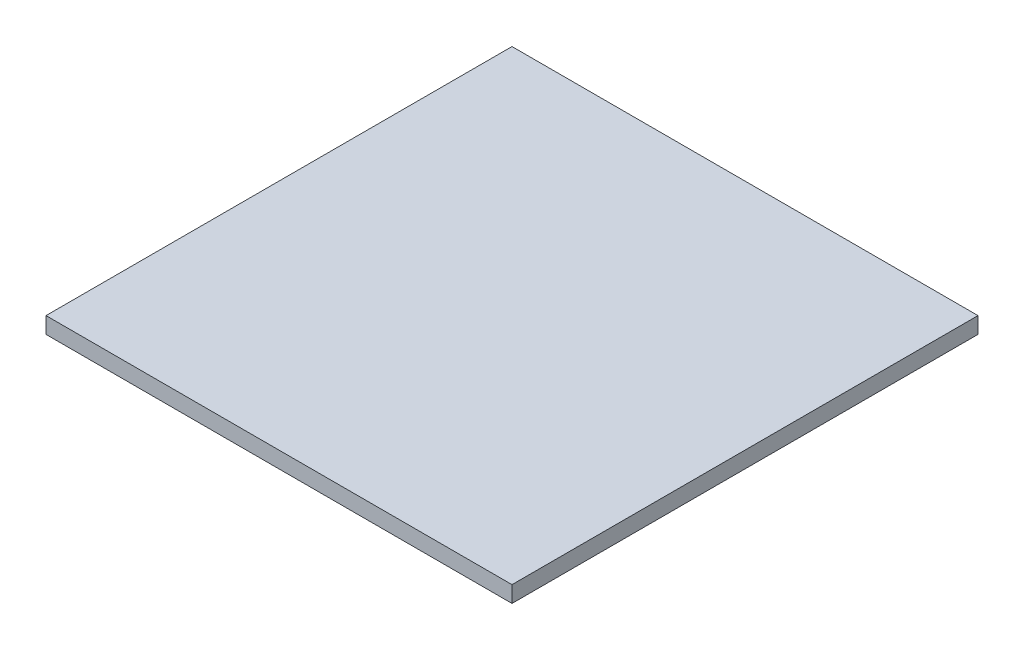
ISO-10303-21;
HEADER;
FILE_DESCRIPTION(('STEP AP214'),'2;1');
FILE_NAME('part.step','',(''),(''),'','','');
FILE_SCHEMA(('AUTOMOTIVE_DESIGN { 1 0 10303 214 1 1 1 1 }'));
ENDSEC;
DATA;
#1=APPLICATION_CONTEXT('core data for automotive mechanical design processes');
#2=APPLICATION_PROTOCOL_DEFINITION('international standard','automotive_design',2000,#1);
#3=PRODUCT_CONTEXT('',#1,'mechanical');
#4=PRODUCT('Part','Part','',(#3));
#5=PRODUCT_RELATED_PRODUCT_CATEGORY('part','',(#4));
#6=PRODUCT_DEFINITION_FORMATION('','',#4);
#7=PRODUCT_DEFINITION_CONTEXT('part definition',#1,'design');
#8=PRODUCT_DEFINITION('design','',#6,#7);
#9=PRODUCT_DEFINITION_SHAPE('','',#8);
#10=(LENGTH_UNIT() NAMED_UNIT(*) SI_UNIT(.MILLI.,.METRE.));
#11=(NAMED_UNIT(*) PLANE_ANGLE_UNIT() SI_UNIT($,.RADIAN.));
#12=(NAMED_UNIT(*) SI_UNIT($,.STERADIAN.) SOLID_ANGLE_UNIT());
#13=UNCERTAINTY_MEASURE_WITH_UNIT(LENGTH_MEASURE(1.E-05),#10,'distance_accuracy_value','');
#14=(GEOMETRIC_REPRESENTATION_CONTEXT(3) GLOBAL_UNCERTAINTY_ASSIGNED_CONTEXT((#13)) GLOBAL_UNIT_ASSIGNED_CONTEXT((#10,
#11,#12)) REPRESENTATION_CONTEXT('',''));
#15=CARTESIAN_POINT('',(0.,0.,0.));
#16=DIRECTION('',(0.,0.,1.));
#17=DIRECTION('',(1.,0.,0.));
#18=AXIS2_PLACEMENT_3D('',#15,#16,#17);
#19=CARTESIAN_POINT('',(0.,3.5,0.));
#20=DIRECTION('',(1.,0.,0.));
#21=DIRECTION('',(0.,0.,-1.));
#22=AXIS2_PLACEMENT_3D('',#19,#20,#21);
#23=PLANE('',#22);
#24=DIRECTION('',(0.,0.,1.));
#25=VECTOR('',#24,1.);
#26=CARTESIAN_POINT('',(0.,0.,0.));
#27=LINE('',#26,#25);
#28=CARTESIAN_POINT('',(0.,0.,-100.));
#29=VERTEX_POINT('',#28);
#30=CARTESIAN_POINT('',(0.,0.,0.));
#31=VERTEX_POINT('',#30);
#32=EDGE_CURVE('E96',#29,#31,#27,.T.);
#33=ORIENTED_EDGE('',*,*,#32,.T.);
#34=DIRECTION('',(0.,-1.,0.));
#35=VECTOR('',#34,1.);
#36=CARTESIAN_POINT('',(0.,3.5,0.));
#37=LINE('',#36,#35);
#38=CARTESIAN_POINT('',(0.,3.5,0.));
#39=VERTEX_POINT('',#38);
#40=EDGE_CURVE('E11',#39,#31,#37,.T.);
#41=ORIENTED_EDGE('',*,*,#40,.F.);
#42=DIRECTION('',(0.,0.,1.));
#43=VECTOR('',#42,1.);
#44=CARTESIAN_POINT('',(0.,3.5,0.));
#45=LINE('',#44,#43);
#46=CARTESIAN_POINT('',(0.,3.5,-100.));
#47=VERTEX_POINT('',#46);
#48=EDGE_CURVE('E84',#47,#39,#45,.T.);
#49=ORIENTED_EDGE('',*,*,#48,.F.);
#50=DIRECTION('',(0.,-1.,0.));
#51=VECTOR('',#50,1.);
#52=CARTESIAN_POINT('',(0.,3.5,-100.));
#53=LINE('',#52,#51);
#54=EDGE_CURVE('E92',#47,#29,#53,.T.);
#55=ORIENTED_EDGE('',*,*,#54,.T.);
#56=EDGE_LOOP('',(#33,#41,#49,#55));
#57=FACE_BOUND('',#56,.T.);
#58=ADVANCED_FACE('F33',(#57),#23,.F.);
#59=CARTESIAN_POINT('',(0.,3.5,0.));
#60=DIRECTION('',(0.,0.,-1.));
#61=DIRECTION('',(-1.,0.,0.));
#62=AXIS2_PLACEMENT_3D('',#59,#60,#61);
#63=PLANE('',#62);
#64=DIRECTION('',(1.,0.,0.));
#65=VECTOR('',#64,1.);
#66=CARTESIAN_POINT('',(0.,0.,0.));
#67=LINE('',#66,#65);
#68=CARTESIAN_POINT('',(100.,0.,0.));
#69=VERTEX_POINT('',#68);
#70=EDGE_CURVE('E88',#31,#69,#67,.T.);
#71=ORIENTED_EDGE('',*,*,#70,.T.);
#72=DIRECTION('',(0.,-1.,0.));
#73=VECTOR('',#72,1.);
#74=CARTESIAN_POINT('',(100.,3.5,0.));
#75=LINE('',#74,#73);
#76=CARTESIAN_POINT('',(100.,3.5,0.));
#77=VERTEX_POINT('',#76);
#78=EDGE_CURVE('E41',#77,#69,#75,.T.);
#79=ORIENTED_EDGE('',*,*,#78,.F.);
#80=DIRECTION('',(1.,0.,0.));
#81=VECTOR('',#80,1.);
#82=CARTESIAN_POINT('',(0.,3.5,0.));
#83=LINE('',#82,#81);
#84=EDGE_CURVE('E79',#39,#77,#83,.T.);
#85=ORIENTED_EDGE('',*,*,#84,.F.);
#86=ORIENTED_EDGE('',*,*,#40,.T.);
#87=EDGE_LOOP('',(#71,#79,#85,#86));
#88=FACE_BOUND('',#87,.T.);
#89=ADVANCED_FACE('F87',(#88),#63,.F.);
#90=CARTESIAN_POINT('',(100.,3.5,0.));
#91=DIRECTION('',(-1.,0.,0.));
#92=DIRECTION('',(0.,0.,1.));
#93=AXIS2_PLACEMENT_3D('',#90,#91,#92);
#94=PLANE('',#93);
#95=DIRECTION('',(0.,0.,-1.));
#96=VECTOR('',#95,1.);
#97=CARTESIAN_POINT('',(100.,0.,0.));
#98=LINE('',#97,#96);
#99=CARTESIAN_POINT('',(100.,0.,-100.));
#100=VERTEX_POINT('',#99);
#101=EDGE_CURVE('E66',#69,#100,#98,.T.);
#102=ORIENTED_EDGE('',*,*,#101,.T.);
#103=DIRECTION('',(0.,-1.,0.));
#104=VECTOR('',#103,1.);
#105=CARTESIAN_POINT('',(100.,3.5,-100.));
#106=LINE('',#105,#104);
#107=CARTESIAN_POINT('',(100.,3.5,-100.));
#108=VERTEX_POINT('',#107);
#109=EDGE_CURVE('E89',#108,#100,#106,.T.);
#110=ORIENTED_EDGE('',*,*,#109,.F.);
#111=DIRECTION('',(0.,0.,-1.));
#112=VECTOR('',#111,1.);
#113=CARTESIAN_POINT('',(100.,3.5,0.));
#114=LINE('',#113,#112);
#115=EDGE_CURVE('E82',#77,#108,#114,.T.);
#116=ORIENTED_EDGE('',*,*,#115,.F.);
#117=ORIENTED_EDGE('',*,*,#78,.T.);
#118=EDGE_LOOP('',(#102,#110,#116,#117));
#119=FACE_BOUND('',#118,.T.);
#120=ADVANCED_FACE('F90',(#119),#94,.F.);
#121=CARTESIAN_POINT('',(0.,3.5,-100.));
#122=DIRECTION('',(0.,0.,1.));
#123=DIRECTION('',(1.,0.,0.));
#124=AXIS2_PLACEMENT_3D('',#121,#122,#123);
#125=PLANE('',#124);
#126=DIRECTION('',(-1.,0.,0.));
#127=VECTOR('',#126,1.);
#128=CARTESIAN_POINT('',(0.,0.,-100.));
#129=LINE('',#128,#127);
#130=EDGE_CURVE('E72',#100,#29,#129,.T.);
#131=ORIENTED_EDGE('',*,*,#130,.T.);
#132=ORIENTED_EDGE('',*,*,#54,.F.);
#133=DIRECTION('',(-1.,0.,0.));
#134=VECTOR('',#133,1.);
#135=CARTESIAN_POINT('',(0.,3.5,-100.));
#136=LINE('',#135,#134);
#137=EDGE_CURVE('E49',#108,#47,#136,.T.);
#138=ORIENTED_EDGE('',*,*,#137,.F.);
#139=ORIENTED_EDGE('',*,*,#109,.T.);
#140=EDGE_LOOP('',(#131,#132,#138,#139));
#141=FACE_BOUND('',#140,.T.);
#142=ADVANCED_FACE('F103',(#141),#125,.F.);
#143=CARTESIAN_POINT('',(0.,3.5,0.));
#144=DIRECTION('',(0.,-1.,0.));
#145=DIRECTION('',(0.,0.,-1.));
#146=AXIS2_PLACEMENT_3D('',#143,#144,#145);
#147=PLANE('',#146);
#148=ORIENTED_EDGE('',*,*,#48,.T.);
#149=ORIENTED_EDGE('',*,*,#84,.T.);
#150=ORIENTED_EDGE('',*,*,#115,.T.);
#151=ORIENTED_EDGE('',*,*,#137,.T.);
#152=EDGE_LOOP('',(#148,#149,#150,#151));
#153=FACE_BOUND('',#152,.T.);
#154=ADVANCED_FACE('F80',(#153),#147,.F.);
#155=CARTESIAN_POINT('',(0.,0.,0.));
#156=DIRECTION('',(0.,-1.,0.));
#157=DIRECTION('',(0.,0.,-1.));
#158=AXIS2_PLACEMENT_3D('',#155,#156,#157);
#159=PLANE('',#158);
#160=ORIENTED_EDGE('',*,*,#32,.F.);
#161=ORIENTED_EDGE('',*,*,#130,.F.);
#162=ORIENTED_EDGE('',*,*,#101,.F.);
#163=ORIENTED_EDGE('',*,*,#70,.F.);
#164=EDGE_LOOP('',(#160,#161,#162,#163));
#165=FACE_BOUND('',#164,.T.);
#166=ADVANCED_FACE('F106',(#165),#159,.T.);
#167=CLOSED_SHELL('',(#58,#89,#120,#142,#154,#166));
#168=MANIFOLD_SOLID_BREP('B2',#167);
#169=ADVANCED_BREP_SHAPE_REPRESENTATION('',(#18,#168),#14);
#170=SHAPE_DEFINITION_REPRESENTATION(#9,#169);
ENDSEC;
END-ISO-10303-21;
